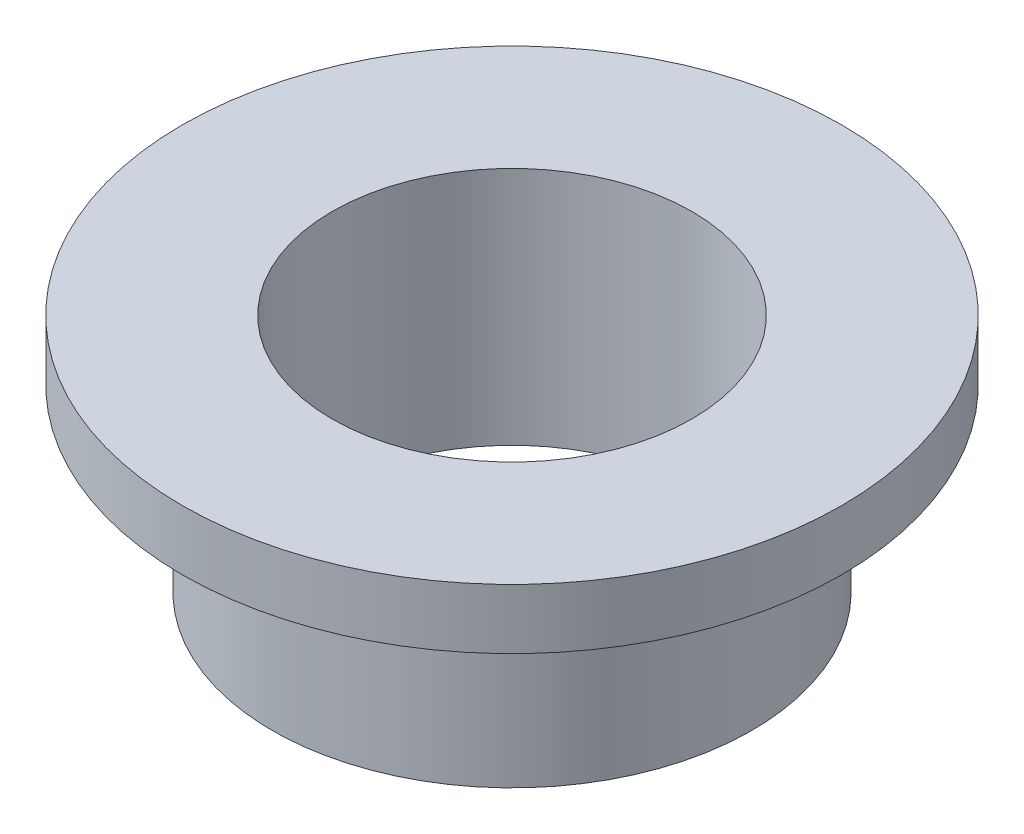
ISO-10303-21;
HEADER;
FILE_DESCRIPTION(('STEP AP214'),'2;1');
FILE_NAME('part.step','',(''),(''),'','','');
FILE_SCHEMA(('AUTOMOTIVE_DESIGN { 1 0 10303 214 1 1 1 1 }'));
ENDSEC;
DATA;
#1=APPLICATION_CONTEXT('core data for automotive mechanical design processes');
#2=APPLICATION_PROTOCOL_DEFINITION('international standard','automotive_design',2000,#1);
#3=PRODUCT_CONTEXT('',#1,'mechanical');
#4=PRODUCT('Part','Part','',(#3));
#5=PRODUCT_RELATED_PRODUCT_CATEGORY('part','',(#4));
#6=PRODUCT_DEFINITION_FORMATION('','',#4);
#7=PRODUCT_DEFINITION_CONTEXT('part definition',#1,'design');
#8=PRODUCT_DEFINITION('design','',#6,#7);
#9=PRODUCT_DEFINITION_SHAPE('','',#8);
#10=(LENGTH_UNIT() NAMED_UNIT(*) SI_UNIT(.MILLI.,.METRE.));
#11=(NAMED_UNIT(*) PLANE_ANGLE_UNIT() SI_UNIT($,.RADIAN.));
#12=(NAMED_UNIT(*) SI_UNIT($,.STERADIAN.) SOLID_ANGLE_UNIT());
#13=UNCERTAINTY_MEASURE_WITH_UNIT(LENGTH_MEASURE(1.E-05),#10,'distance_accuracy_value','');
#14=(GEOMETRIC_REPRESENTATION_CONTEXT(3) GLOBAL_UNCERTAINTY_ASSIGNED_CONTEXT((#13)) GLOBAL_UNIT_ASSIGNED_CONTEXT((#10,
#11,#12)) REPRESENTATION_CONTEXT('',''));
#15=CARTESIAN_POINT('',(0.,0.,0.));
#16=DIRECTION('',(0.,0.,1.));
#17=DIRECTION('',(1.,0.,0.));
#18=AXIS2_PLACEMENT_3D('',#15,#16,#17);
#19=CARTESIAN_POINT('',(0.,-55.,0.));
#20=DIRECTION('',(0.,-1.,0.));
#21=DIRECTION('',(0.,0.,-1.));
#22=AXIS2_PLACEMENT_3D('',#19,#20,#21);
#23=CYLINDRICAL_SURFACE('',#22,4.7625);
#24=CARTESIAN_POINT('',(0.,-17.9883503566271,0.));
#25=DIRECTION('',(0.,-1.,0.));
#26=DIRECTION('',(0.,0.,-1.));
#27=AXIS2_PLACEMENT_3D('',#24,#25,#26);
#28=CIRCLE('',#27,4.7625);
#29=CARTESIAN_POINT('',(0.,-17.9883503566271,-4.7625));
#30=VERTEX_POINT('',#29);
#31=EDGE_CURVE('E53',#30,#30,#28,.T.);
#32=ORIENTED_EDGE('',*,*,#31,.T.);
#33=EDGE_LOOP('',(#32));
#34=FACE_BOUND('',#33,.T.);
#35=CARTESIAN_POINT('',(0.,-11.6383503566271,0.));
#36=DIRECTION('',(0.,-1.,0.));
#37=DIRECTION('',(0.,0.,-1.));
#38=AXIS2_PLACEMENT_3D('',#35,#36,#37);
#39=CIRCLE('',#38,4.7625);
#40=CARTESIAN_POINT('',(0.,-11.6383503566271,-4.7625));
#41=VERTEX_POINT('',#40);
#42=EDGE_CURVE('E10',#41,#41,#39,.T.);
#43=ORIENTED_EDGE('',*,*,#42,.F.);
#44=EDGE_LOOP('',(#43));
#45=FACE_BOUND('',#44,.T.);
#46=ADVANCED_FACE('F31',(#34,#45),#23,.F.);
#47=CARTESIAN_POINT('',(4.7625,-11.6383503566271,0.));
#48=DIRECTION('',(0.,1.,0.));
#49=DIRECTION('',(0.,0.,1.));
#50=AXIS2_PLACEMENT_3D('',#47,#48,#49);
#51=PLANE('',#50);
#52=ORIENTED_EDGE('',*,*,#42,.T.);
#53=EDGE_LOOP('',(#52));
#54=FACE_BOUND('',#53,.T.);
#55=CARTESIAN_POINT('',(0.,-11.6383503566271,0.));
#56=DIRECTION('',(0.,-1.,0.));
#57=DIRECTION('',(0.,0.,-1.));
#58=AXIS2_PLACEMENT_3D('',#55,#56,#57);
#59=CIRCLE('',#58,8.73125);
#60=CARTESIAN_POINT('',(0.,-11.6383503566271,-8.73125));
#61=VERTEX_POINT('',#60);
#62=EDGE_CURVE('E37',#61,#61,#59,.T.);
#63=ORIENTED_EDGE('',*,*,#62,.F.);
#64=EDGE_LOOP('',(#63));
#65=FACE_BOUND('',#64,.T.);
#66=ADVANCED_FACE('F71',(#54,#65),#51,.T.);
#67=CARTESIAN_POINT('',(0.,-55.,0.));
#68=DIRECTION('',(0.,-1.,0.));
#69=DIRECTION('',(0.,0.,-1.));
#70=AXIS2_PLACEMENT_3D('',#67,#68,#69);
#71=CYLINDRICAL_SURFACE('',#70,8.73125);
#72=ORIENTED_EDGE('',*,*,#62,.T.);
#73=EDGE_LOOP('',(#72));
#74=FACE_BOUND('',#73,.T.);
#75=CARTESIAN_POINT('',(0.,-13.2258503566271,0.));
#76=DIRECTION('',(0.,-1.,0.));
#77=DIRECTION('',(0.,0.,-1.));
#78=AXIS2_PLACEMENT_3D('',#75,#76,#77);
#79=CIRCLE('',#78,8.73125);
#80=CARTESIAN_POINT('',(0.,-13.2258503566271,-8.73125));
#81=VERTEX_POINT('',#80);
#82=EDGE_CURVE('E41',#81,#81,#79,.T.);
#83=ORIENTED_EDGE('',*,*,#82,.F.);
#84=EDGE_LOOP('',(#83));
#85=FACE_BOUND('',#84,.T.);
#86=ADVANCED_FACE('F75',(#74,#85),#71,.T.);
#87=CARTESIAN_POINT('',(8.73125,-13.225850356627,0.));
#88=DIRECTION('',(0.,-1.,0.));
#89=DIRECTION('',(0.,0.,-1.));
#90=AXIS2_PLACEMENT_3D('',#87,#88,#89);
#91=PLANE('',#90);
#92=ORIENTED_EDGE('',*,*,#82,.T.);
#93=EDGE_LOOP('',(#92));
#94=FACE_BOUND('',#93,.T.);
#95=CARTESIAN_POINT('',(0.,-13.225850356627,0.));
#96=DIRECTION('',(0.,-1.,0.));
#97=DIRECTION('',(0.,0.,-1.));
#98=AXIS2_PLACEMENT_3D('',#95,#96,#97);
#99=CIRCLE('',#98,6.35);
#100=CARTESIAN_POINT('',(0.,-13.225850356627,-6.35));
#101=VERTEX_POINT('',#100);
#102=EDGE_CURVE('E45',#101,#101,#99,.T.);
#103=ORIENTED_EDGE('',*,*,#102,.F.);
#104=EDGE_LOOP('',(#103));
#105=FACE_BOUND('',#104,.T.);
#106=ADVANCED_FACE('F67',(#94,#105),#91,.T.);
#107=CARTESIAN_POINT('',(0.,-55.,0.));
#108=DIRECTION('',(0.,-1.,0.));
#109=DIRECTION('',(0.,0.,-1.));
#110=AXIS2_PLACEMENT_3D('',#107,#108,#109);
#111=CYLINDRICAL_SURFACE('',#110,6.35);
#112=ORIENTED_EDGE('',*,*,#102,.T.);
#113=EDGE_LOOP('',(#112));
#114=FACE_BOUND('',#113,.T.);
#115=CARTESIAN_POINT('',(0.,-17.9883503566271,0.));
#116=DIRECTION('',(0.,-1.,0.));
#117=DIRECTION('',(0.,0.,-1.));
#118=AXIS2_PLACEMENT_3D('',#115,#116,#117);
#119=CIRCLE('',#118,6.35);
#120=CARTESIAN_POINT('',(0.,-17.9883503566271,-6.35));
#121=VERTEX_POINT('',#120);
#122=EDGE_CURVE('E50',#121,#121,#119,.T.);
#123=ORIENTED_EDGE('',*,*,#122,.F.);
#124=EDGE_LOOP('',(#123));
#125=FACE_BOUND('',#124,.T.);
#126=ADVANCED_FACE('F61',(#114,#125),#111,.T.);
#127=CARTESIAN_POINT('',(6.35,-17.9883503566271,0.));
#128=DIRECTION('',(0.,-1.,0.));
#129=DIRECTION('',(0.,0.,-1.));
#130=AXIS2_PLACEMENT_3D('',#127,#128,#129);
#131=PLANE('',#130);
#132=ORIENTED_EDGE('',*,*,#122,.T.);
#133=EDGE_LOOP('',(#132));
#134=FACE_BOUND('',#133,.T.);
#135=ORIENTED_EDGE('',*,*,#31,.F.);
#136=EDGE_LOOP('',(#135));
#137=FACE_BOUND('',#136,.T.);
#138=ADVANCED_FACE('F59',(#134,#137),#131,.T.);
#139=CLOSED_SHELL('',(#46,#66,#86,#106,#126,#138));
#140=MANIFOLD_SOLID_BREP('B2',#139);
#141=ADVANCED_BREP_SHAPE_REPRESENTATION('',(#18,#140),#14);
#142=SHAPE_DEFINITION_REPRESENTATION(#9,#141);
ENDSEC;
END-ISO-10303-21;
